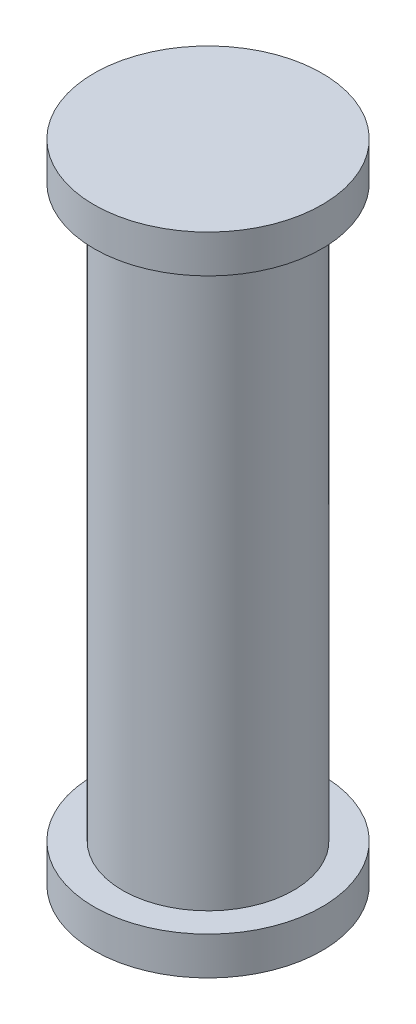
ISO-10303-21;
HEADER;
FILE_DESCRIPTION(('STEP AP214'),'2;1');
FILE_NAME('part.step','',(''),(''),'','','');
FILE_SCHEMA(('AUTOMOTIVE_DESIGN { 1 0 10303 214 1 1 1 1 }'));
ENDSEC;
DATA;
#1=APPLICATION_CONTEXT('core data for automotive mechanical design processes');
#2=APPLICATION_PROTOCOL_DEFINITION('international standard','automotive_design',2000,#1);
#3=PRODUCT_CONTEXT('',#1,'mechanical');
#4=PRODUCT('Part','Part','',(#3));
#5=PRODUCT_RELATED_PRODUCT_CATEGORY('part','',(#4));
#6=PRODUCT_DEFINITION_FORMATION('','',#4);
#7=PRODUCT_DEFINITION_CONTEXT('part definition',#1,'design');
#8=PRODUCT_DEFINITION('design','',#6,#7);
#9=PRODUCT_DEFINITION_SHAPE('','',#8);
#10=(LENGTH_UNIT() NAMED_UNIT(*) SI_UNIT(.MILLI.,.METRE.));
#11=(NAMED_UNIT(*) PLANE_ANGLE_UNIT() SI_UNIT($,.RADIAN.));
#12=(NAMED_UNIT(*) SI_UNIT($,.STERADIAN.) SOLID_ANGLE_UNIT());
#13=UNCERTAINTY_MEASURE_WITH_UNIT(LENGTH_MEASURE(1.E-05),#10,'distance_accuracy_value','');
#14=(GEOMETRIC_REPRESENTATION_CONTEXT(3) GLOBAL_UNCERTAINTY_ASSIGNED_CONTEXT((#13)) GLOBAL_UNIT_ASSIGNED_CONTEXT((#10,
#11,#12)) REPRESENTATION_CONTEXT('',''));
#15=CARTESIAN_POINT('',(0.,0.,0.));
#16=DIRECTION('',(0.,0.,1.));
#17=DIRECTION('',(1.,0.,0.));
#18=AXIS2_PLACEMENT_3D('',#15,#16,#17);
#19=CARTESIAN_POINT('',(0.,30.,0.));
#20=DIRECTION('',(0.,-1.,0.));
#21=DIRECTION('',(0.,0.,-1.));
#22=AXIS2_PLACEMENT_3D('',#19,#20,#21);
#23=CYLINDRICAL_SURFACE('',#22,4.5);
#24=CARTESIAN_POINT('',(0.,30.,0.));
#25=DIRECTION('',(0.,1.,0.));
#26=DIRECTION('',(0.,0.,1.));
#27=AXIS2_PLACEMENT_3D('',#24,#25,#26);
#28=CIRCLE('',#27,4.5);
#29=CARTESIAN_POINT('',(0.,30.,4.5));
#30=VERTEX_POINT('',#29);
#31=EDGE_CURVE('E10',#30,#30,#28,.T.);
#32=ORIENTED_EDGE('',*,*,#31,.F.);
#33=EDGE_LOOP('',(#32));
#34=FACE_BOUND('',#33,.T.);
#35=CARTESIAN_POINT('',(0.,0.,0.));
#36=DIRECTION('',(0.,1.,0.));
#37=DIRECTION('',(0.,0.,1.));
#38=AXIS2_PLACEMENT_3D('',#35,#36,#37);
#39=CIRCLE('',#38,4.5);
#40=CARTESIAN_POINT('',(0.,0.,4.5));
#41=VERTEX_POINT('',#40);
#42=EDGE_CURVE('E46',#41,#41,#39,.T.);
#43=ORIENTED_EDGE('',*,*,#42,.T.);
#44=EDGE_LOOP('',(#43));
#45=FACE_BOUND('',#44,.T.);
#46=ADVANCED_FACE('F43',(#34,#45),#23,.T.);
#47=CARTESIAN_POINT('',(0.,-2.,0.));
#48=DIRECTION('',(0.,1.,0.));
#49=DIRECTION('',(0.,0.,1.));
#50=AXIS2_PLACEMENT_3D('',#47,#48,#49);
#51=CYLINDRICAL_SURFACE('',#50,6.);
#52=CARTESIAN_POINT('',(0.,-2.,0.));
#53=DIRECTION('',(0.,1.,0.));
#54=DIRECTION('',(0.,0.,1.));
#55=AXIS2_PLACEMENT_3D('',#52,#53,#54);
#56=CIRCLE('',#55,6.);
#57=CARTESIAN_POINT('',(0.,-2.,6.));
#58=VERTEX_POINT('',#57);
#59=EDGE_CURVE('E55',#58,#58,#56,.T.);
#60=ORIENTED_EDGE('',*,*,#59,.T.);
#61=EDGE_LOOP('',(#60));
#62=FACE_BOUND('',#61,.T.);
#63=CARTESIAN_POINT('',(0.,0.,0.));
#64=DIRECTION('',(0.,1.,0.));
#65=DIRECTION('',(0.,0.,1.));
#66=AXIS2_PLACEMENT_3D('',#63,#64,#65);
#67=CIRCLE('',#66,6.);
#68=CARTESIAN_POINT('',(0.,0.,6.));
#69=VERTEX_POINT('',#68);
#70=EDGE_CURVE('E57',#69,#69,#67,.T.);
#71=ORIENTED_EDGE('',*,*,#70,.F.);
#72=EDGE_LOOP('',(#71));
#73=FACE_BOUND('',#72,.T.);
#74=ADVANCED_FACE('F90',(#62,#73),#51,.T.);
#75=CARTESIAN_POINT('',(0.,-2.,0.));
#76=DIRECTION('',(0.,1.,0.));
#77=DIRECTION('',(0.,0.,1.));
#78=AXIS2_PLACEMENT_3D('',#75,#76,#77);
#79=PLANE('',#78);
#80=ORIENTED_EDGE('',*,*,#59,.F.);
#81=EDGE_LOOP('',(#80));
#82=FACE_BOUND('',#81,.T.);
#83=ADVANCED_FACE('F95',(#82),#79,.F.);
#84=CARTESIAN_POINT('',(0.,0.,0.));
#85=DIRECTION('',(0.,1.,0.));
#86=DIRECTION('',(0.,0.,1.));
#87=AXIS2_PLACEMENT_3D('',#84,#85,#86);
#88=PLANE('',#87);
#89=ORIENTED_EDGE('',*,*,#42,.F.);
#90=EDGE_LOOP('',(#89));
#91=FACE_BOUND('',#90,.T.);
#92=ORIENTED_EDGE('',*,*,#70,.T.);
#93=EDGE_LOOP('',(#92));
#94=FACE_BOUND('',#93,.T.);
#95=ADVANCED_FACE('F78',(#91,#94),#88,.T.);
#96=CARTESIAN_POINT('',(0.,32.,0.));
#97=DIRECTION('',(0.,-1.,0.));
#98=DIRECTION('',(0.,0.,-1.));
#99=AXIS2_PLACEMENT_3D('',#96,#97,#98);
#100=CYLINDRICAL_SURFACE('',#99,6.);
#101=CARTESIAN_POINT('',(0.,32.,0.));
#102=DIRECTION('',(0.,1.,0.));
#103=DIRECTION('',(0.,0.,1.));
#104=AXIS2_PLACEMENT_3D('',#101,#102,#103);
#105=CIRCLE('',#104,6.);
#106=CARTESIAN_POINT('',(0.,32.,6.));
#107=VERTEX_POINT('',#106);
#108=EDGE_CURVE('E61',#107,#107,#105,.T.);
#109=ORIENTED_EDGE('',*,*,#108,.F.);
#110=EDGE_LOOP('',(#109));
#111=FACE_BOUND('',#110,.T.);
#112=CARTESIAN_POINT('',(0.,30.,0.));
#113=DIRECTION('',(0.,1.,0.));
#114=DIRECTION('',(0.,0.,1.));
#115=AXIS2_PLACEMENT_3D('',#112,#113,#114);
#116=CIRCLE('',#115,6.);
#117=CARTESIAN_POINT('',(0.,30.,6.));
#118=VERTEX_POINT('',#117);
#119=EDGE_CURVE('E65',#118,#118,#116,.T.);
#120=ORIENTED_EDGE('',*,*,#119,.T.);
#121=EDGE_LOOP('',(#120));
#122=FACE_BOUND('',#121,.T.);
#123=ADVANCED_FACE('F75',(#111,#122),#100,.T.);
#124=CARTESIAN_POINT('',(0.,32.,0.));
#125=DIRECTION('',(0.,1.,0.));
#126=DIRECTION('',(0.,0.,1.));
#127=AXIS2_PLACEMENT_3D('',#124,#125,#126);
#128=PLANE('',#127);
#129=ORIENTED_EDGE('',*,*,#108,.T.);
#130=EDGE_LOOP('',(#129));
#131=FACE_BOUND('',#130,.T.);
#132=ADVANCED_FACE('F73',(#131),#128,.T.);
#133=CARTESIAN_POINT('',(0.,30.,0.));
#134=DIRECTION('',(0.,1.,0.));
#135=DIRECTION('',(0.,0.,1.));
#136=AXIS2_PLACEMENT_3D('',#133,#134,#135);
#137=PLANE('',#136);
#138=ORIENTED_EDGE('',*,*,#31,.T.);
#139=EDGE_LOOP('',(#138));
#140=FACE_BOUND('',#139,.T.);
#141=ORIENTED_EDGE('',*,*,#119,.F.);
#142=EDGE_LOOP('',(#141));
#143=FACE_BOUND('',#142,.T.);
#144=ADVANCED_FACE('F82',(#140,#143),#137,.F.);
#145=CLOSED_SHELL('',(#46,#74,#83,#95,#123,#132,#144));
#146=MANIFOLD_SOLID_BREP('B2',#145);
#147=ADVANCED_BREP_SHAPE_REPRESENTATION('',(#18,#146),#14);
#148=SHAPE_DEFINITION_REPRESENTATION(#9,#147);
ENDSEC;
END-ISO-10303-21;
